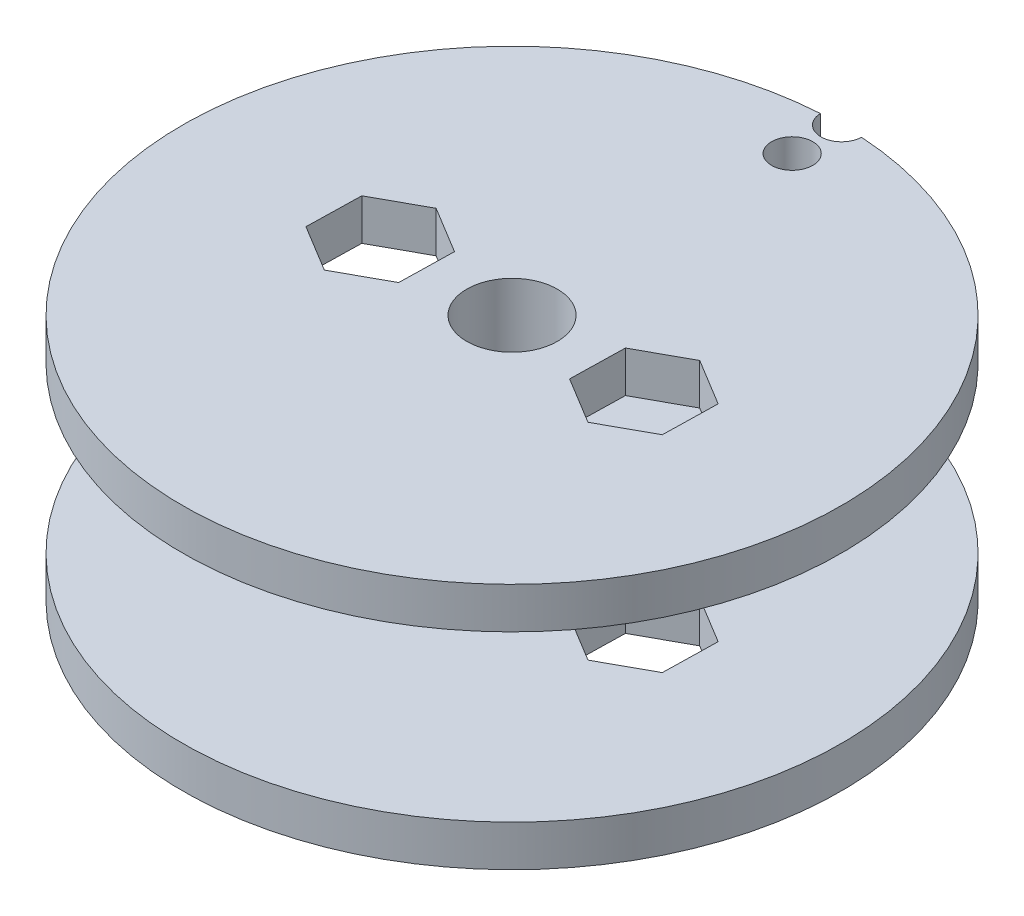
ISO-10303-21;
HEADER;
FILE_DESCRIPTION(('STEP AP214'),'2;1');
FILE_NAME('part.step','',(''),(''),'','','');
FILE_SCHEMA(('AUTOMOTIVE_DESIGN { 1 0 10303 214 1 1 1 1 }'));
ENDSEC;
DATA;
#1=APPLICATION_CONTEXT('core data for automotive mechanical design processes');
#2=APPLICATION_PROTOCOL_DEFINITION('international standard','automotive_design',2000,#1);
#3=PRODUCT_CONTEXT('',#1,'mechanical');
#4=PRODUCT('Part','Part','',(#3));
#5=PRODUCT_RELATED_PRODUCT_CATEGORY('part','',(#4));
#6=PRODUCT_DEFINITION_FORMATION('','',#4);
#7=PRODUCT_DEFINITION_CONTEXT('part definition',#1,'design');
#8=PRODUCT_DEFINITION('design','',#6,#7);
#9=PRODUCT_DEFINITION_SHAPE('','',#8);
#10=(LENGTH_UNIT() NAMED_UNIT(*) SI_UNIT(.MILLI.,.METRE.));
#11=(NAMED_UNIT(*) PLANE_ANGLE_UNIT() SI_UNIT($,.RADIAN.));
#12=(NAMED_UNIT(*) SI_UNIT($,.STERADIAN.) SOLID_ANGLE_UNIT());
#13=UNCERTAINTY_MEASURE_WITH_UNIT(LENGTH_MEASURE(1.E-05),#10,'distance_accuracy_value','');
#14=(GEOMETRIC_REPRESENTATION_CONTEXT(3) GLOBAL_UNCERTAINTY_ASSIGNED_CONTEXT((#13)) GLOBAL_UNIT_ASSIGNED_CONTEXT((#10,
#11,#12)) REPRESENTATION_CONTEXT('',''));
#15=CARTESIAN_POINT('',(0.,0.,0.));
#16=DIRECTION('',(0.,0.,1.));
#17=DIRECTION('',(1.,0.,0.));
#18=AXIS2_PLACEMENT_3D('',#15,#16,#17);
#19=CARTESIAN_POINT('',(0.,2.5,0.));
#20=DIRECTION('',(0.,1.,0.));
#21=DIRECTION('',(0.,0.,1.));
#22=AXIS2_PLACEMENT_3D('',#19,#20,#21);
#23=PLANE('',#22);
#24=DIRECTION('',(-0.0214869779830933,0.,0.999769128237692));
#25=VECTOR('',#24,1.);
#26=CARTESIAN_POINT('',(-5.08999790781407,2.5,-1.59772374233));
#27=LINE('',#26,#25);
#28=CARTESIAN_POINT('',(-5.08999790781407,2.5,-1.59772374233));
#29=VERTEX_POINT('',#28);
#30=CARTESIAN_POINT('',(-5.16132960481908,2.5,1.72127386573417));
#31=VERTEX_POINT('',#30);
#32=EDGE_CURVE('E484',#29,#31,#27,.T.);
#33=ORIENTED_EDGE('',*,*,#32,.T.);
#34=DIRECTION('',(-0.87656895196481,0.,0.48127629533493));
#35=VECTOR('',#34,1.);
#36=CARTESIAN_POINT('',(-5.16132960481908,2.5,1.72127386573417));
#37=LINE('',#36,#35);
#38=CARTESIAN_POINT('',(-8.07133169700495,2.5,3.31899760806487));
#39=VERTEX_POINT('',#38);
#40=EDGE_CURVE('E488',#31,#39,#37,.T.);
#41=ORIENTED_EDGE('',*,*,#40,.T.);
#42=DIRECTION('',(-0.855081973981716,0.,-0.518492832902762));
#43=VECTOR('',#42,1.);
#44=CARTESIAN_POINT('',(-8.07133169700495,2.5,3.31899760806487));
#45=LINE('',#44,#43);
#46=CARTESIAN_POINT('',(-10.9100020921858,2.5,1.59772374233139));
#47=VERTEX_POINT('',#46);
#48=EDGE_CURVE('E493',#39,#47,#45,.T.);
#49=ORIENTED_EDGE('',*,*,#48,.T.);
#50=DIRECTION('',(0.0214869779830943,0.,-0.999769128237692));
#51=VECTOR('',#50,1.);
#52=CARTESIAN_POINT('',(-10.9100020921858,2.5,1.59772374233139));
#53=LINE('',#52,#51);
#54=CARTESIAN_POINT('',(-10.8386703951808,2.5,-1.72127386573279));
#55=VERTEX_POINT('',#54);
#56=EDGE_CURVE('E497',#47,#55,#53,.T.);
#57=ORIENTED_EDGE('',*,*,#56,.T.);
#58=DIRECTION('',(0.87656895196481,0.,-0.48127629533493));
#59=VECTOR('',#58,1.);
#60=CARTESIAN_POINT('',(-10.8386703951808,2.5,-1.72127386573279));
#61=LINE('',#60,#59);
#62=CARTESIAN_POINT('',(-7.92866830299493,2.5,-3.31899760806348));
#63=VERTEX_POINT('',#62);
#64=EDGE_CURVE('E501',#55,#63,#61,.T.);
#65=ORIENTED_EDGE('',*,*,#64,.T.);
#66=DIRECTION('',(0.855081973981716,0.,0.518492832902762));
#67=VECTOR('',#66,1.);
#68=CARTESIAN_POINT('',(-7.92866830299493,2.5,-3.31899760806348));
#69=LINE('',#68,#67);
#70=EDGE_CURVE('E505',#63,#29,#69,.T.);
#71=ORIENTED_EDGE('',*,*,#70,.T.);
#72=EDGE_LOOP('',(#33,#41,#49,#57,#65,#71));
#73=FACE_BOUND('',#72,.T.);
#74=DIRECTION('',(0.0214869779832137,0.,-0.999769128237689));
#75=VECTOR('',#74,1.);
#76=CARTESIAN_POINT('',(5.089997907814,2.5,1.59772374233007));
#77=LINE('',#76,#75);
#78=CARTESIAN_POINT('',(5.089997907814,2.5,1.59772374233007));
#79=VERTEX_POINT('',#78);
#80=CARTESIAN_POINT('',(5.16132960481941,2.5,-1.72127386573409));
#81=VERTEX_POINT('',#80);
#82=EDGE_CURVE('E418',#79,#81,#77,.T.);
#83=ORIENTED_EDGE('',*,*,#82,.T.);
#84=DIRECTION('',(0.876568951964868,0.,-0.481276295334824));
#85=VECTOR('',#84,1.);
#86=CARTESIAN_POINT('',(5.16132960481941,2.5,-1.72127386573409));
#87=LINE('',#86,#85);
#88=CARTESIAN_POINT('',(8.07133169700547,2.5,-3.31899760806444));
#89=VERTEX_POINT('',#88);
#90=EDGE_CURVE('E422',#81,#89,#87,.T.);
#91=ORIENTED_EDGE('',*,*,#90,.T.);
#92=DIRECTION('',(0.855081973981654,0.,0.518492832902865));
#93=VECTOR('',#92,1.);
#94=CARTESIAN_POINT('',(8.07133169700547,2.5,-3.31899760806444));
#95=LINE('',#94,#93);
#96=CARTESIAN_POINT('',(10.9100020921861,2.5,-1.59772374233061));
#97=VERTEX_POINT('',#96);
#98=EDGE_CURVE('E64',#89,#97,#95,.T.);
#99=ORIENTED_EDGE('',*,*,#98,.T.);
#100=DIRECTION('',(-0.021486977983214,0.,0.999769128237689));
#101=VECTOR('',#100,1.);
#102=CARTESIAN_POINT('',(10.9100020921861,2.5,-1.59772374233061));
#103=LINE('',#102,#101);
#104=CARTESIAN_POINT('',(10.8386703951807,2.5,1.72127386573356));
#105=VERTEX_POINT('',#104);
#106=EDGE_CURVE('E429',#97,#105,#103,.T.);
#107=ORIENTED_EDGE('',*,*,#106,.T.);
#108=DIRECTION('',(-0.876568951964868,0.,0.481276295334824));
#109=VECTOR('',#108,1.);
#110=CARTESIAN_POINT('',(10.8386703951807,2.5,1.72127386573356));
#111=LINE('',#110,#109);
#112=CARTESIAN_POINT('',(7.92866830299465,2.5,3.3189976080639));
#113=VERTEX_POINT('',#112);
#114=EDGE_CURVE('E433',#105,#113,#111,.T.);
#115=ORIENTED_EDGE('',*,*,#114,.T.);
#116=DIRECTION('',(-0.855081973981654,0.,-0.518492832902865));
#117=VECTOR('',#116,1.);
#118=CARTESIAN_POINT('',(7.92866830299465,2.5,3.3189976080639));
#119=LINE('',#118,#117);
#120=EDGE_CURVE('E437',#113,#79,#119,.T.);
#121=ORIENTED_EDGE('',*,*,#120,.T.);
#122=EDGE_LOOP('',(#83,#91,#99,#107,#115,#121));
#123=FACE_BOUND('',#122,.T.);
#124=CARTESIAN_POINT('',(0.,2.5,-20.));
#125=DIRECTION('',(0.,1.,0.));
#126=DIRECTION('',(0.,0.,1.));
#127=AXIS2_PLACEMENT_3D('',#124,#125,#126);
#128=CIRCLE('',#127,1.25);
#129=CARTESIAN_POINT('',(-1.24938949935309,2.5,-19.9609375));
#130=VERTEX_POINT('',#129);
#131=CARTESIAN_POINT('',(1.24938949935309,2.5,-19.9609375));
#132=VERTEX_POINT('',#131);
#133=EDGE_CURVE('E409',#130,#132,#128,.T.);
#134=ORIENTED_EDGE('',*,*,#133,.F.);
#135=CARTESIAN_POINT('',(0.,2.5,0.));
#136=DIRECTION('',(0.,1.,0.));
#137=DIRECTION('',(0.,0.,1.));
#138=AXIS2_PLACEMENT_3D('',#135,#136,#137);
#139=CIRCLE('',#138,20.);
#140=EDGE_CURVE('E553',#130,#132,#139,.T.);
#141=ORIENTED_EDGE('',*,*,#140,.T.);
#142=EDGE_LOOP('',(#134,#141));
#143=FACE_BOUND('',#142,.T.);
#144=CARTESIAN_POINT('',(0.,2.5,-17.));
#145=DIRECTION('',(0.,1.,0.));
#146=DIRECTION('',(0.,0.,1.));
#147=AXIS2_PLACEMENT_3D('',#144,#145,#146);
#148=CIRCLE('',#147,1.25);
#149=CARTESIAN_POINT('',(0.,2.5,-15.75));
#150=VERTEX_POINT('',#149);
#151=EDGE_CURVE('E410',#150,#150,#148,.T.);
#152=ORIENTED_EDGE('',*,*,#151,.F.);
#153=EDGE_LOOP('',(#152));
#154=FACE_BOUND('',#153,.T.);
#155=CARTESIAN_POINT('',(0.,2.5,0.));
#156=DIRECTION('',(0.,1.,0.));
#157=DIRECTION('',(0.,0.,1.));
#158=AXIS2_PLACEMENT_3D('',#155,#156,#157);
#159=CIRCLE('',#158,3.);
#160=CARTESIAN_POINT('',(0.,2.5,3.));
#161=VERTEX_POINT('',#160);
#162=EDGE_CURVE('E237',#161,#161,#159,.T.);
#163=ORIENTED_EDGE('',*,*,#162,.F.);
#164=EDGE_LOOP('',(#163));
#165=FACE_BOUND('',#164,.T.);
#166=ADVANCED_FACE('F39',(#73,#123,#143,#154,#165),#23,.T.);
#167=CARTESIAN_POINT('',(0.,0.,0.));
#168=DIRECTION('',(0.,1.,0.));
#169=DIRECTION('',(0.,0.,1.));
#170=AXIS2_PLACEMENT_3D('',#167,#168,#169);
#171=PLANE('',#170);
#172=CARTESIAN_POINT('',(0.,0.,-17.));
#173=DIRECTION('',(0.,1.,0.));
#174=DIRECTION('',(0.,0.,1.));
#175=AXIS2_PLACEMENT_3D('',#172,#173,#174);
#176=CIRCLE('',#175,1.25);
#177=CARTESIAN_POINT('',(0.,0.,-15.75));
#178=VERTEX_POINT('',#177);
#179=EDGE_CURVE('E43',#178,#178,#176,.T.);
#180=ORIENTED_EDGE('',*,*,#179,.T.);
#181=EDGE_LOOP('',(#180));
#182=FACE_BOUND('',#181,.T.);
#183=DIRECTION('',(0.876568951964868,0.,-0.481276295334824));
#184=VECTOR('',#183,1.);
#185=CARTESIAN_POINT('',(5.16132960481941,0.,-1.72127386573409));
#186=LINE('',#185,#184);
#187=CARTESIAN_POINT('',(5.16132960481941,0.,-1.72127386573409));
#188=VERTEX_POINT('',#187);
#189=CARTESIAN_POINT('',(8.07133169700547,0.,-3.31899760806444));
#190=VERTEX_POINT('',#189);
#191=EDGE_CURVE('E445',#188,#190,#186,.T.);
#192=ORIENTED_EDGE('',*,*,#191,.F.);
#193=DIRECTION('',(0.0214869779832137,0.,-0.999769128237689));
#194=VECTOR('',#193,1.);
#195=CARTESIAN_POINT('',(5.089997907814,0.,1.59772374233007));
#196=LINE('',#195,#194);
#197=CARTESIAN_POINT('',(5.089997907814,0.,1.59772374233007));
#198=VERTEX_POINT('',#197);
#199=EDGE_CURVE('E442',#198,#188,#196,.T.);
#200=ORIENTED_EDGE('',*,*,#199,.F.);
#201=DIRECTION('',(-0.855081973981654,0.,-0.518492832902865));
#202=VECTOR('',#201,1.);
#203=CARTESIAN_POINT('',(7.92866830299465,0.,3.3189976080639));
#204=LINE('',#203,#202);
#205=CARTESIAN_POINT('',(7.92866830299465,0.,3.3189976080639));
#206=VERTEX_POINT('',#205);
#207=EDGE_CURVE('E423',#206,#198,#204,.T.);
#208=ORIENTED_EDGE('',*,*,#207,.F.);
#209=DIRECTION('',(-0.876568951964868,0.,0.481276295334824));
#210=VECTOR('',#209,1.);
#211=CARTESIAN_POINT('',(10.8386703951807,0.,1.72127386573356));
#212=LINE('',#211,#210);
#213=CARTESIAN_POINT('',(10.8386703951807,0.,1.72127386573356));
#214=VERTEX_POINT('',#213);
#215=EDGE_CURVE('E458',#214,#206,#212,.T.);
#216=ORIENTED_EDGE('',*,*,#215,.F.);
#217=DIRECTION('',(-0.021486977983214,0.,0.999769128237689));
#218=VECTOR('',#217,1.);
#219=CARTESIAN_POINT('',(10.9100020921861,0.,-1.59772374233061));
#220=LINE('',#219,#218);
#221=CARTESIAN_POINT('',(10.9100020921861,0.,-1.59772374233061));
#222=VERTEX_POINT('',#221);
#223=EDGE_CURVE('E454',#222,#214,#220,.T.);
#224=ORIENTED_EDGE('',*,*,#223,.F.);
#225=DIRECTION('',(0.855081973981654,0.,0.518492832902865));
#226=VECTOR('',#225,1.);
#227=CARTESIAN_POINT('',(8.07133169700547,0.,-3.31899760806444));
#228=LINE('',#227,#226);
#229=EDGE_CURVE('E450',#190,#222,#228,.T.);
#230=ORIENTED_EDGE('',*,*,#229,.F.);
#231=EDGE_LOOP('',(#192,#200,#208,#216,#224,#230));
#232=FACE_BOUND('',#231,.T.);
#233=DIRECTION('',(-0.87656895196481,0.,0.48127629533493));
#234=VECTOR('',#233,1.);
#235=CARTESIAN_POINT('',(-5.16132960481908,0.,1.72127386573417));
#236=LINE('',#235,#234);
#237=CARTESIAN_POINT('',(-5.16132960481908,0.,1.72127386573417));
#238=VERTEX_POINT('',#237);
#239=CARTESIAN_POINT('',(-8.07133169700495,0.,3.31899760806487));
#240=VERTEX_POINT('',#239);
#241=EDGE_CURVE('E513',#238,#240,#236,.T.);
#242=ORIENTED_EDGE('',*,*,#241,.F.);
#243=DIRECTION('',(-0.0214869779830933,0.,0.999769128237692));
#244=VECTOR('',#243,1.);
#245=CARTESIAN_POINT('',(-5.08999790781407,0.,-1.59772374233));
#246=LINE('',#245,#244);
#247=CARTESIAN_POINT('',(-5.08999790781407,0.,-1.59772374233));
#248=VERTEX_POINT('',#247);
#249=EDGE_CURVE('E510',#248,#238,#246,.T.);
#250=ORIENTED_EDGE('',*,*,#249,.F.);
#251=DIRECTION('',(0.855081973981716,0.,0.518492832902762));
#252=VECTOR('',#251,1.);
#253=CARTESIAN_POINT('',(-7.92866830299493,0.,-3.31899760806348));
#254=LINE('',#253,#252);
#255=CARTESIAN_POINT('',(-7.92866830299493,0.,-3.31899760806348));
#256=VERTEX_POINT('',#255);
#257=EDGE_CURVE('E489',#256,#248,#254,.T.);
#258=ORIENTED_EDGE('',*,*,#257,.F.);
#259=DIRECTION('',(0.87656895196481,0.,-0.48127629533493));
#260=VECTOR('',#259,1.);
#261=CARTESIAN_POINT('',(-10.8386703951808,0.,-1.72127386573279));
#262=LINE('',#261,#260);
#263=CARTESIAN_POINT('',(-10.8386703951808,0.,-1.72127386573279));
#264=VERTEX_POINT('',#263);
#265=EDGE_CURVE('E525',#264,#256,#262,.T.);
#266=ORIENTED_EDGE('',*,*,#265,.F.);
#267=DIRECTION('',(0.0214869779830943,0.,-0.999769128237692));
#268=VECTOR('',#267,1.);
#269=CARTESIAN_POINT('',(-10.9100020921858,0.,1.59772374233139));
#270=LINE('',#269,#268);
#271=CARTESIAN_POINT('',(-10.9100020921858,0.,1.59772374233139));
#272=VERTEX_POINT('',#271);
#273=EDGE_CURVE('E521',#272,#264,#270,.T.);
#274=ORIENTED_EDGE('',*,*,#273,.F.);
#275=DIRECTION('',(-0.855081973981716,0.,-0.518492832902762));
#276=VECTOR('',#275,1.);
#277=CARTESIAN_POINT('',(-8.07133169700495,0.,3.31899760806487));
#278=LINE('',#277,#276);
#279=EDGE_CURVE('E517',#240,#272,#278,.T.);
#280=ORIENTED_EDGE('',*,*,#279,.F.);
#281=EDGE_LOOP('',(#242,#250,#258,#266,#274,#280));
#282=FACE_BOUND('',#281,.T.);
#283=CARTESIAN_POINT('',(0.,0.,0.));
#284=DIRECTION('',(0.,1.,0.));
#285=DIRECTION('',(0.,0.,1.));
#286=AXIS2_PLACEMENT_3D('',#283,#284,#285);
#287=CIRCLE('',#286,20.);
#288=CARTESIAN_POINT('',(-1.24938949935309,0.,-19.9609375));
#289=VERTEX_POINT('',#288);
#290=CARTESIAN_POINT('',(1.24938949935308,0.,-19.9609375));
#291=VERTEX_POINT('',#290);
#292=EDGE_CURVE('E552',#289,#291,#287,.T.);
#293=ORIENTED_EDGE('',*,*,#292,.F.);
#294=CARTESIAN_POINT('',(0.,0.,-20.));
#295=DIRECTION('',(0.,1.,0.));
#296=DIRECTION('',(0.,0.,1.));
#297=AXIS2_PLACEMENT_3D('',#294,#295,#296);
#298=CIRCLE('',#297,1.25);
#299=EDGE_CURVE('E56',#289,#291,#298,.T.);
#300=ORIENTED_EDGE('',*,*,#299,.T.);
#301=EDGE_LOOP('',(#293,#300));
#302=FACE_BOUND('',#301,.T.);
#303=CARTESIAN_POINT('',(0.,0.,0.));
#304=DIRECTION('',(0.,1.,0.));
#305=DIRECTION('',(0.,0.,1.));
#306=AXIS2_PLACEMENT_3D('',#303,#304,#305);
#307=CIRCLE('',#306,2.75);
#308=CARTESIAN_POINT('',(0.,0.,2.75));
#309=VERTEX_POINT('',#308);
#310=EDGE_CURVE('E468',#309,#309,#307,.T.);
#311=ORIENTED_EDGE('',*,*,#310,.T.);
#312=EDGE_LOOP('',(#311));
#313=FACE_BOUND('',#312,.T.);
#314=ADVANCED_FACE('F566',(#182,#232,#282,#302,#313),#171,.F.);
#315=CARTESIAN_POINT('',(0.,2.5,0.));
#316=DIRECTION('',(0.,-1.,0.));
#317=DIRECTION('',(0.,0.,-1.));
#318=AXIS2_PLACEMENT_3D('',#315,#316,#317);
#319=CYLINDRICAL_SURFACE('',#318,20.);
#320=ORIENTED_EDGE('',*,*,#292,.T.);
#321=DIRECTION('',(0.,1.,0.));
#322=VECTOR('',#321,1.);
#323=CARTESIAN_POINT('',(1.24938949935309,0.,-19.9609375));
#324=LINE('',#323,#322);
#325=EDGE_CURVE('E11',#291,#132,#324,.T.);
#326=ORIENTED_EDGE('',*,*,#325,.T.);
#327=ORIENTED_EDGE('',*,*,#140,.F.);
#328=DIRECTION('',(0.,1.,0.));
#329=VECTOR('',#328,1.);
#330=CARTESIAN_POINT('',(-1.24938949935309,0.,-19.9609375));
#331=LINE('',#330,#329);
#332=EDGE_CURVE('E49',#130,#289,#331,.F.);
#333=ORIENTED_EDGE('',*,*,#332,.T.);
#334=EDGE_LOOP('',(#320,#326,#327,#333));
#335=FACE_BOUND('',#334,.T.);
#336=ADVANCED_FACE('F41',(#335),#319,.T.);
#337=CARTESIAN_POINT('',(0.,2.5,0.));
#338=DIRECTION('',(0.,-1.,0.));
#339=DIRECTION('',(0.,0.,-1.));
#340=AXIS2_PLACEMENT_3D('',#337,#338,#339);
#341=CYLINDRICAL_SURFACE('',#340,2.75);
#342=ORIENTED_EDGE('',*,*,#310,.F.);
#343=EDGE_LOOP('',(#342));
#344=FACE_BOUND('',#343,.T.);
#345=CARTESIAN_POINT('',(0.,15.,0.));
#346=DIRECTION('',(0.,1.,0.));
#347=DIRECTION('',(0.,0.,1.));
#348=AXIS2_PLACEMENT_3D('',#345,#346,#347);
#349=CIRCLE('',#348,2.75);
#350=CARTESIAN_POINT('',(0.,15.,2.75));
#351=VERTEX_POINT('',#350);
#352=EDGE_CURVE('E316',#351,#351,#349,.T.);
#353=ORIENTED_EDGE('',*,*,#352,.T.);
#354=EDGE_LOOP('',(#353));
#355=FACE_BOUND('',#354,.T.);
#356=ADVANCED_FACE('F572',(#344,#355),#341,.F.);
#357=CARTESIAN_POINT('',(-5.08999790781407,2.5,-1.59772374233));
#358=DIRECTION('',(0.999769128237692,0.,0.0214869779830933));
#359=DIRECTION('',(0.0214869779830933,0.,-0.999769128237692));
#360=AXIS2_PLACEMENT_3D('',#357,#358,#359);
#361=PLANE('',#360);
#362=ORIENTED_EDGE('',*,*,#249,.T.);
#363=DIRECTION('',(0.,-1.,0.));
#364=VECTOR('',#363,1.);
#365=CARTESIAN_POINT('',(-5.16132960481908,2.5,1.72127386573417));
#366=LINE('',#365,#364);
#367=EDGE_CURVE('E509',#31,#238,#366,.T.);
#368=ORIENTED_EDGE('',*,*,#367,.F.);
#369=ORIENTED_EDGE('',*,*,#32,.F.);
#370=DIRECTION('',(0.,-1.,0.));
#371=VECTOR('',#370,1.);
#372=CARTESIAN_POINT('',(-5.08999790781407,2.5,-1.59772374233));
#373=LINE('',#372,#371);
#374=EDGE_CURVE('E446',#29,#248,#373,.T.);
#375=ORIENTED_EDGE('',*,*,#374,.T.);
#376=EDGE_LOOP('',(#362,#368,#369,#375));
#377=FACE_BOUND('',#376,.T.);
#378=ADVANCED_FACE('F575',(#377),#361,.F.);
#379=CARTESIAN_POINT('',(-7.92866830299493,2.5,-3.31899760806348));
#380=DIRECTION('',(0.518492832902762,0.,-0.855081973981716));
#381=DIRECTION('',(-0.855081973981716,0.,-0.518492832902762));
#382=AXIS2_PLACEMENT_3D('',#379,#380,#381);
#383=PLANE('',#382);
#384=ORIENTED_EDGE('',*,*,#257,.T.);
#385=ORIENTED_EDGE('',*,*,#374,.F.);
#386=ORIENTED_EDGE('',*,*,#70,.F.);
#387=DIRECTION('',(0.,-1.,0.));
#388=VECTOR('',#387,1.);
#389=CARTESIAN_POINT('',(-7.92866830299493,2.5,-3.31899760806348));
#390=LINE('',#389,#388);
#391=EDGE_CURVE('E534',#63,#256,#390,.T.);
#392=ORIENTED_EDGE('',*,*,#391,.T.);
#393=EDGE_LOOP('',(#384,#385,#386,#392));
#394=FACE_BOUND('',#393,.T.);
#395=ADVANCED_FACE('F603',(#394),#383,.F.);
#396=CARTESIAN_POINT('',(-10.8386703951808,2.5,-1.72127386573279));
#397=DIRECTION('',(-0.48127629533493,0.,-0.87656895196481));
#398=DIRECTION('',(-0.87656895196481,0.,0.48127629533493));
#399=AXIS2_PLACEMENT_3D('',#396,#397,#398);
#400=PLANE('',#399);
#401=ORIENTED_EDGE('',*,*,#265,.T.);
#402=ORIENTED_EDGE('',*,*,#391,.F.);
#403=ORIENTED_EDGE('',*,*,#64,.F.);
#404=DIRECTION('',(0.,-1.,0.));
#405=VECTOR('',#404,1.);
#406=CARTESIAN_POINT('',(-10.8386703951808,2.5,-1.72127386573279));
#407=LINE('',#406,#405);
#408=EDGE_CURVE('E537',#55,#264,#407,.T.);
#409=ORIENTED_EDGE('',*,*,#408,.T.);
#410=EDGE_LOOP('',(#401,#402,#403,#409));
#411=FACE_BOUND('',#410,.T.);
#412=ADVANCED_FACE('F617',(#411),#400,.F.);
#413=CARTESIAN_POINT('',(-10.9100020921858,2.5,1.59772374233139));
#414=DIRECTION('',(-0.999769128237692,0.,-0.0214869779830943));
#415=DIRECTION('',(-0.0214869779830943,0.,0.999769128237692));
#416=AXIS2_PLACEMENT_3D('',#413,#414,#415);
#417=PLANE('',#416);
#418=ORIENTED_EDGE('',*,*,#273,.T.);
#419=ORIENTED_EDGE('',*,*,#408,.F.);
#420=ORIENTED_EDGE('',*,*,#56,.F.);
#421=DIRECTION('',(0.,-1.,0.));
#422=VECTOR('',#421,1.);
#423=CARTESIAN_POINT('',(-10.9100020921858,2.5,1.59772374233139));
#424=LINE('',#423,#422);
#425=EDGE_CURVE('E540',#47,#272,#424,.T.);
#426=ORIENTED_EDGE('',*,*,#425,.T.);
#427=EDGE_LOOP('',(#418,#419,#420,#426));
#428=FACE_BOUND('',#427,.T.);
#429=ADVANCED_FACE('F613',(#428),#417,.F.);
#430=CARTESIAN_POINT('',(-8.07133169700495,2.5,3.31899760806487));
#431=DIRECTION('',(-0.518492832902762,0.,0.855081973981716));
#432=DIRECTION('',(0.855081973981716,0.,0.518492832902762));
#433=AXIS2_PLACEMENT_3D('',#430,#431,#432);
#434=PLANE('',#433);
#435=ORIENTED_EDGE('',*,*,#279,.T.);
#436=ORIENTED_EDGE('',*,*,#425,.F.);
#437=ORIENTED_EDGE('',*,*,#48,.F.);
#438=DIRECTION('',(0.,-1.,0.));
#439=VECTOR('',#438,1.);
#440=CARTESIAN_POINT('',(-8.07133169700495,2.5,3.31899760806487));
#441=LINE('',#440,#439);
#442=EDGE_CURVE('E543',#39,#240,#441,.T.);
#443=ORIENTED_EDGE('',*,*,#442,.T.);
#444=EDGE_LOOP('',(#435,#436,#437,#443));
#445=FACE_BOUND('',#444,.T.);
#446=ADVANCED_FACE('F609',(#445),#434,.F.);
#447=CARTESIAN_POINT('',(-5.16132960481908,2.5,1.72127386573417));
#448=DIRECTION('',(0.48127629533493,0.,0.87656895196481));
#449=DIRECTION('',(0.87656895196481,0.,-0.48127629533493));
#450=AXIS2_PLACEMENT_3D('',#447,#448,#449);
#451=PLANE('',#450);
#452=ORIENTED_EDGE('',*,*,#241,.T.);
#453=ORIENTED_EDGE('',*,*,#442,.F.);
#454=ORIENTED_EDGE('',*,*,#40,.F.);
#455=ORIENTED_EDGE('',*,*,#367,.T.);
#456=EDGE_LOOP('',(#452,#453,#454,#455));
#457=FACE_BOUND('',#456,.T.);
#458=ADVANCED_FACE('F605',(#457),#451,.F.);
#459=CARTESIAN_POINT('',(5.089997907814,2.5,1.59772374233007));
#460=DIRECTION('',(-0.999769128237689,0.,-0.0214869779832137));
#461=DIRECTION('',(-0.0214869779832137,0.,0.999769128237689));
#462=AXIS2_PLACEMENT_3D('',#459,#460,#461);
#463=PLANE('',#462);
#464=ORIENTED_EDGE('',*,*,#199,.T.);
#465=DIRECTION('',(0.,-1.,0.));
#466=VECTOR('',#465,1.);
#467=CARTESIAN_POINT('',(5.16132960481941,2.5,-1.72127386573409));
#468=LINE('',#467,#466);
#469=EDGE_CURVE('E441',#81,#188,#468,.T.);
#470=ORIENTED_EDGE('',*,*,#469,.F.);
#471=ORIENTED_EDGE('',*,*,#82,.F.);
#472=DIRECTION('',(0.,-1.,0.));
#473=VECTOR('',#472,1.);
#474=CARTESIAN_POINT('',(5.089997907814,2.5,1.59772374233007));
#475=LINE('',#474,#473);
#476=EDGE_CURVE('E465',#79,#198,#475,.T.);
#477=ORIENTED_EDGE('',*,*,#476,.T.);
#478=EDGE_LOOP('',(#464,#470,#471,#477));
#479=FACE_BOUND('',#478,.T.);
#480=ADVANCED_FACE('F608',(#479),#463,.F.);
#481=CARTESIAN_POINT('',(7.92866830299465,2.5,3.3189976080639));
#482=DIRECTION('',(-0.518492832902865,0.,0.855081973981654));
#483=DIRECTION('',(0.855081973981654,0.,0.518492832902865));
#484=AXIS2_PLACEMENT_3D('',#481,#482,#483);
#485=PLANE('',#484);
#486=ORIENTED_EDGE('',*,*,#207,.T.);
#487=ORIENTED_EDGE('',*,*,#476,.F.);
#488=ORIENTED_EDGE('',*,*,#120,.F.);
#489=DIRECTION('',(0.,-1.,0.));
#490=VECTOR('',#489,1.);
#491=CARTESIAN_POINT('',(7.92866830299465,2.5,3.3189976080639));
#492=LINE('',#491,#490);
#493=EDGE_CURVE('E469',#113,#206,#492,.T.);
#494=ORIENTED_EDGE('',*,*,#493,.T.);
#495=EDGE_LOOP('',(#486,#487,#488,#494));
#496=FACE_BOUND('',#495,.T.);
#497=ADVANCED_FACE('F627',(#496),#485,.F.);
#498=CARTESIAN_POINT('',(10.8386703951807,2.5,1.72127386573356));
#499=DIRECTION('',(0.481276295334824,0.,0.876568951964868));
#500=DIRECTION('',(0.876568951964868,0.,-0.481276295334824));
#501=AXIS2_PLACEMENT_3D('',#498,#499,#500);
#502=PLANE('',#501);
#503=ORIENTED_EDGE('',*,*,#215,.T.);
#504=ORIENTED_EDGE('',*,*,#493,.F.);
#505=ORIENTED_EDGE('',*,*,#114,.F.);
#506=DIRECTION('',(0.,-1.,0.));
#507=VECTOR('',#506,1.);
#508=CARTESIAN_POINT('',(10.8386703951807,2.5,1.72127386573356));
#509=LINE('',#508,#507);
#510=EDGE_CURVE('E472',#105,#214,#509,.T.);
#511=ORIENTED_EDGE('',*,*,#510,.T.);
#512=EDGE_LOOP('',(#503,#504,#505,#511));
#513=FACE_BOUND('',#512,.T.);
#514=ADVANCED_FACE('F640',(#513),#502,.F.);
#515=CARTESIAN_POINT('',(10.9100020921861,2.5,-1.59772374233061));
#516=DIRECTION('',(0.999769128237689,0.,0.021486977983214));
#517=DIRECTION('',(0.021486977983214,0.,-0.999769128237689));
#518=AXIS2_PLACEMENT_3D('',#515,#516,#517);
#519=PLANE('',#518);
#520=ORIENTED_EDGE('',*,*,#223,.T.);
#521=ORIENTED_EDGE('',*,*,#510,.F.);
#522=ORIENTED_EDGE('',*,*,#106,.F.);
#523=DIRECTION('',(0.,-1.,0.));
#524=VECTOR('',#523,1.);
#525=CARTESIAN_POINT('',(10.9100020921861,2.5,-1.59772374233061));
#526=LINE('',#525,#524);
#527=EDGE_CURVE('E475',#97,#222,#526,.T.);
#528=ORIENTED_EDGE('',*,*,#527,.T.);
#529=EDGE_LOOP('',(#520,#521,#522,#528));
#530=FACE_BOUND('',#529,.T.);
#531=ADVANCED_FACE('F637',(#530),#519,.F.);
#532=CARTESIAN_POINT('',(8.07133169700547,2.5,-3.31899760806444));
#533=DIRECTION('',(0.518492832902865,0.,-0.855081973981654));
#534=DIRECTION('',(-0.855081973981654,0.,-0.518492832902865));
#535=AXIS2_PLACEMENT_3D('',#532,#533,#534);
#536=PLANE('',#535);
#537=ORIENTED_EDGE('',*,*,#229,.T.);
#538=ORIENTED_EDGE('',*,*,#527,.F.);
#539=ORIENTED_EDGE('',*,*,#98,.F.);
#540=DIRECTION('',(0.,-1.,0.));
#541=VECTOR('',#540,1.);
#542=CARTESIAN_POINT('',(8.07133169700547,2.5,-3.31899760806444));
#543=LINE('',#542,#541);
#544=EDGE_CURVE('E478',#89,#190,#543,.T.);
#545=ORIENTED_EDGE('',*,*,#544,.T.);
#546=EDGE_LOOP('',(#537,#538,#539,#545));
#547=FACE_BOUND('',#546,.T.);
#548=ADVANCED_FACE('F633',(#547),#536,.F.);
#549=CARTESIAN_POINT('',(5.16132960481941,2.5,-1.72127386573409));
#550=DIRECTION('',(-0.481276295334824,0.,-0.876568951964868));
#551=DIRECTION('',(-0.876568951964868,0.,0.481276295334825));
#552=AXIS2_PLACEMENT_3D('',#549,#550,#551);
#553=PLANE('',#552);
#554=ORIENTED_EDGE('',*,*,#191,.T.);
#555=ORIENTED_EDGE('',*,*,#544,.F.);
#556=ORIENTED_EDGE('',*,*,#90,.F.);
#557=ORIENTED_EDGE('',*,*,#469,.T.);
#558=EDGE_LOOP('',(#554,#555,#556,#557));
#559=FACE_BOUND('',#558,.T.);
#560=ADVANCED_FACE('F629',(#559),#553,.F.);
#561=CARTESIAN_POINT('',(0.,-2.5,-20.));
#562=DIRECTION('',(0.,1.,0.));
#563=DIRECTION('',(0.,0.,1.));
#564=AXIS2_PLACEMENT_3D('',#561,#562,#563);
#565=CYLINDRICAL_SURFACE('',#564,1.25);
#566=ORIENTED_EDGE('',*,*,#299,.F.);
#567=ORIENTED_EDGE('',*,*,#332,.F.);
#568=ORIENTED_EDGE('',*,*,#133,.T.);
#569=ORIENTED_EDGE('',*,*,#325,.F.);
#570=EDGE_LOOP('',(#566,#567,#568,#569));
#571=FACE_BOUND('',#570,.T.);
#572=ADVANCED_FACE('F632',(#571),#565,.F.);
#573=CARTESIAN_POINT('',(0.,-2.5,-17.));
#574=DIRECTION('',(0.,1.,0.));
#575=DIRECTION('',(0.,0.,1.));
#576=AXIS2_PLACEMENT_3D('',#573,#574,#575);
#577=CYLINDRICAL_SURFACE('',#576,1.25);
#578=ORIENTED_EDGE('',*,*,#151,.T.);
#579=EDGE_LOOP('',(#578));
#580=FACE_BOUND('',#579,.T.);
#581=ORIENTED_EDGE('',*,*,#179,.F.);
#582=EDGE_LOOP('',(#581));
#583=FACE_BOUND('',#582,.T.);
#584=ADVANCED_FACE('F650',(#580,#583),#577,.F.);
#585=CARTESIAN_POINT('',(0.,7.5,0.));
#586=DIRECTION('',(0.,-1.,0.));
#587=DIRECTION('',(0.,0.,-1.));
#588=AXIS2_PLACEMENT_3D('',#585,#586,#587);
#589=CYLINDRICAL_SURFACE('',#588,3.);
#590=ORIENTED_EDGE('',*,*,#162,.T.);
#591=EDGE_LOOP('',(#590));
#592=FACE_BOUND('',#591,.T.);
#593=CARTESIAN_POINT('',(0.,12.5,0.));
#594=DIRECTION('',(0.,1.,0.));
#595=DIRECTION('',(0.,0.,1.));
#596=AXIS2_PLACEMENT_3D('',#593,#594,#595);
#597=CIRCLE('',#596,3.);
#598=CARTESIAN_POINT('',(0.,12.5,3.));
#599=VERTEX_POINT('',#598);
#600=EDGE_CURVE('E251',#599,#599,#597,.T.);
#601=ORIENTED_EDGE('',*,*,#600,.F.);
#602=EDGE_LOOP('',(#601));
#603=FACE_BOUND('',#602,.T.);
#604=ADVANCED_FACE('F589',(#592,#603),#589,.T.);
#605=CARTESIAN_POINT('',(0.,12.5,0.));
#606=DIRECTION('',(0.,-1.,0.));
#607=DIRECTION('',(0.,0.,1.));
#608=AXIS2_PLACEMENT_3D('',#605,#606,#607);
#609=PLANE('',#608);
#610=DIRECTION('',(-0.0214869779830933,0.,0.999769128237692));
#611=VECTOR('',#610,1.);
#612=CARTESIAN_POINT('',(-5.08999790781407,12.5,-1.59772374233));
#613=LINE('',#612,#611);
#614=CARTESIAN_POINT('',(-5.08999790781407,12.5,-1.59772374233));
#615=VERTEX_POINT('',#614);
#616=CARTESIAN_POINT('',(-5.16132960481908,12.5,1.72127386573417));
#617=VERTEX_POINT('',#616);
#618=EDGE_CURVE('E331',#615,#617,#613,.T.);
#619=ORIENTED_EDGE('',*,*,#618,.F.);
#620=DIRECTION('',(0.855081973981716,0.,0.518492832902762));
#621=VECTOR('',#620,1.);
#622=CARTESIAN_POINT('',(-7.92866830299493,12.5,-3.31899760806348));
#623=LINE('',#622,#621);
#624=CARTESIAN_POINT('',(-7.92866830299493,12.5,-3.31899760806348));
#625=VERTEX_POINT('',#624);
#626=EDGE_CURVE('E352',#625,#615,#623,.T.);
#627=ORIENTED_EDGE('',*,*,#626,.F.);
#628=DIRECTION('',(0.87656895196481,0.,-0.48127629533493));
#629=VECTOR('',#628,1.);
#630=CARTESIAN_POINT('',(-10.8386703951808,12.5,-1.72127386573279));
#631=LINE('',#630,#629);
#632=CARTESIAN_POINT('',(-10.8386703951808,12.5,-1.72127386573279));
#633=VERTEX_POINT('',#632);
#634=EDGE_CURVE('E348',#633,#625,#631,.T.);
#635=ORIENTED_EDGE('',*,*,#634,.F.);
#636=DIRECTION('',(0.0214869779830943,0.,-0.999769128237692));
#637=VECTOR('',#636,1.);
#638=CARTESIAN_POINT('',(-10.9100020921858,12.5,1.59772374233139));
#639=LINE('',#638,#637);
#640=CARTESIAN_POINT('',(-10.9100020921858,12.5,1.59772374233139));
#641=VERTEX_POINT('',#640);
#642=EDGE_CURVE('E344',#641,#633,#639,.T.);
#643=ORIENTED_EDGE('',*,*,#642,.F.);
#644=DIRECTION('',(-0.855081973981716,0.,-0.518492832902762));
#645=VECTOR('',#644,1.);
#646=CARTESIAN_POINT('',(-8.07133169700495,12.5,3.31899760806487));
#647=LINE('',#646,#645);
#648=CARTESIAN_POINT('',(-8.07133169700495,12.5,3.31899760806487));
#649=VERTEX_POINT('',#648);
#650=EDGE_CURVE('E340',#649,#641,#647,.T.);
#651=ORIENTED_EDGE('',*,*,#650,.F.);
#652=DIRECTION('',(-0.87656895196481,0.,0.48127629533493));
#653=VECTOR('',#652,1.);
#654=CARTESIAN_POINT('',(-5.16132960481908,12.5,1.72127386573417));
#655=LINE('',#654,#653);
#656=EDGE_CURVE('E335',#617,#649,#655,.T.);
#657=ORIENTED_EDGE('',*,*,#656,.F.);
#658=EDGE_LOOP('',(#619,#627,#635,#643,#651,#657));
#659=FACE_BOUND('',#658,.T.);
#660=DIRECTION('',(0.0214869779832137,0.,-0.999769128237689));
#661=VECTOR('',#660,1.);
#662=CARTESIAN_POINT('',(5.089997907814,12.5,1.59772374233007));
#663=LINE('',#662,#661);
#664=CARTESIAN_POINT('',(5.089997907814,12.5,1.59772374233007));
#665=VERTEX_POINT('',#664);
#666=CARTESIAN_POINT('',(5.16132960481941,12.5,-1.72127386573409));
#667=VERTEX_POINT('',#666);
#668=EDGE_CURVE('E263',#665,#667,#663,.T.);
#669=ORIENTED_EDGE('',*,*,#668,.F.);
#670=DIRECTION('',(-0.855081973981654,0.,-0.518492832902865));
#671=VECTOR('',#670,1.);
#672=CARTESIAN_POINT('',(7.92866830299465,12.5,3.3189976080639));
#673=LINE('',#672,#671);
#674=CARTESIAN_POINT('',(7.92866830299465,12.5,3.3189976080639));
#675=VERTEX_POINT('',#674);
#676=EDGE_CURVE('E284',#675,#665,#673,.T.);
#677=ORIENTED_EDGE('',*,*,#676,.F.);
#678=DIRECTION('',(-0.876568951964868,0.,0.481276295334824));
#679=VECTOR('',#678,1.);
#680=CARTESIAN_POINT('',(10.8386703951807,12.5,1.72127386573356));
#681=LINE('',#680,#679);
#682=CARTESIAN_POINT('',(10.8386703951807,12.5,1.72127386573356));
#683=VERTEX_POINT('',#682);
#684=EDGE_CURVE('E280',#683,#675,#681,.T.);
#685=ORIENTED_EDGE('',*,*,#684,.F.);
#686=DIRECTION('',(-0.021486977983214,0.,0.999769128237689));
#687=VECTOR('',#686,1.);
#688=CARTESIAN_POINT('',(10.9100020921861,12.5,-1.59772374233061));
#689=LINE('',#688,#687);
#690=CARTESIAN_POINT('',(10.9100020921861,12.5,-1.59772374233061));
#691=VERTEX_POINT('',#690);
#692=EDGE_CURVE('E276',#691,#683,#689,.T.);
#693=ORIENTED_EDGE('',*,*,#692,.F.);
#694=DIRECTION('',(0.855081973981654,0.,0.518492832902865));
#695=VECTOR('',#694,1.);
#696=CARTESIAN_POINT('',(8.07133169700547,12.5,-3.31899760806444));
#697=LINE('',#696,#695);
#698=CARTESIAN_POINT('',(8.07133169700547,12.5,-3.31899760806444));
#699=VERTEX_POINT('',#698);
#700=EDGE_CURVE('E272',#699,#691,#697,.T.);
#701=ORIENTED_EDGE('',*,*,#700,.F.);
#702=DIRECTION('',(0.876568951964868,0.,-0.481276295334824));
#703=VECTOR('',#702,1.);
#704=CARTESIAN_POINT('',(5.16132960481941,12.5,-1.72127386573409));
#705=LINE('',#704,#703);
#706=EDGE_CURVE('E267',#667,#699,#705,.T.);
#707=ORIENTED_EDGE('',*,*,#706,.F.);
#708=EDGE_LOOP('',(#669,#677,#685,#693,#701,#707));
#709=FACE_BOUND('',#708,.T.);
#710=CARTESIAN_POINT('',(0.,12.5,-20.));
#711=DIRECTION('',(0.,1.,0.));
#712=DIRECTION('',(0.,0.,1.));
#713=AXIS2_PLACEMENT_3D('',#710,#711,#712);
#714=CIRCLE('',#713,1.25);
#715=CARTESIAN_POINT('',(-1.24938949935309,12.5,-19.9609375));
#716=VERTEX_POINT('',#715);
#717=CARTESIAN_POINT('',(1.24938949935309,12.5,-19.9609375));
#718=VERTEX_POINT('',#717);
#719=EDGE_CURVE('E230',#716,#718,#714,.T.);
#720=ORIENTED_EDGE('',*,*,#719,.T.);
#721=CARTESIAN_POINT('',(0.,12.5,0.));
#722=DIRECTION('',(0.,1.,0.));
#723=DIRECTION('',(0.,0.,1.));
#724=AXIS2_PLACEMENT_3D('',#721,#722,#723);
#725=CIRCLE('',#724,20.);
#726=EDGE_CURVE('E241',#716,#718,#725,.T.);
#727=ORIENTED_EDGE('',*,*,#726,.F.);
#728=EDGE_LOOP('',(#720,#727));
#729=FACE_BOUND('',#728,.T.);
#730=CARTESIAN_POINT('',(0.,12.5,-17.));
#731=DIRECTION('',(0.,1.,0.));
#732=DIRECTION('',(0.,0.,1.));
#733=AXIS2_PLACEMENT_3D('',#730,#731,#732);
#734=CIRCLE('',#733,1.25);
#735=CARTESIAN_POINT('',(0.,12.5,-15.75));
#736=VERTEX_POINT('',#735);
#737=EDGE_CURVE('E250',#736,#736,#734,.T.);
#738=ORIENTED_EDGE('',*,*,#737,.T.);
#739=EDGE_LOOP('',(#738));
#740=FACE_BOUND('',#739,.T.);
#741=ORIENTED_EDGE('',*,*,#600,.T.);
#742=EDGE_LOOP('',(#741));
#743=FACE_BOUND('',#742,.T.);
#744=ADVANCED_FACE('F247',(#659,#709,#729,#740,#743),#609,.T.);
#745=CARTESIAN_POINT('',(0.,15.,0.));
#746=DIRECTION('',(0.,-1.,0.));
#747=DIRECTION('',(0.,0.,1.));
#748=AXIS2_PLACEMENT_3D('',#745,#746,#747);
#749=PLANE('',#748);
#750=CARTESIAN_POINT('',(0.,15.,-17.));
#751=DIRECTION('',(0.,1.,0.));
#752=DIRECTION('',(0.,0.,1.));
#753=AXIS2_PLACEMENT_3D('',#750,#751,#752);
#754=CIRCLE('',#753,1.25);
#755=CARTESIAN_POINT('',(0.,15.,-15.75));
#756=VERTEX_POINT('',#755);
#757=EDGE_CURVE('E262',#756,#756,#754,.T.);
#758=ORIENTED_EDGE('',*,*,#757,.F.);
#759=EDGE_LOOP('',(#758));
#760=FACE_BOUND('',#759,.T.);
#761=DIRECTION('',(0.876568951964868,0.,-0.481276295334824));
#762=VECTOR('',#761,1.);
#763=CARTESIAN_POINT('',(5.16132960481941,15.,-1.72127386573409));
#764=LINE('',#763,#762);
#765=CARTESIAN_POINT('',(5.16132960481941,15.,-1.72127386573409));
#766=VERTEX_POINT('',#765);
#767=CARTESIAN_POINT('',(8.07133169700547,15.,-3.31899760806444));
#768=VERTEX_POINT('',#767);
#769=EDGE_CURVE('E293',#766,#768,#764,.T.);
#770=ORIENTED_EDGE('',*,*,#769,.T.);
#771=DIRECTION('',(0.855081973981654,0.,0.518492832902865));
#772=VECTOR('',#771,1.);
#773=CARTESIAN_POINT('',(8.07133169700547,15.,-3.31899760806444));
#774=LINE('',#773,#772);
#775=CARTESIAN_POINT('',(10.9100020921861,15.,-1.59772374233061));
#776=VERTEX_POINT('',#775);
#777=EDGE_CURVE('E298',#768,#776,#774,.T.);
#778=ORIENTED_EDGE('',*,*,#777,.T.);
#779=DIRECTION('',(-0.021486977983214,0.,0.999769128237689));
#780=VECTOR('',#779,1.);
#781=CARTESIAN_POINT('',(10.9100020921861,15.,-1.59772374233061));
#782=LINE('',#781,#780);
#783=CARTESIAN_POINT('',(10.8386703951807,15.,1.72127386573356));
#784=VERTEX_POINT('',#783);
#785=EDGE_CURVE('E302',#776,#784,#782,.T.);
#786=ORIENTED_EDGE('',*,*,#785,.T.);
#787=DIRECTION('',(-0.876568951964868,0.,0.481276295334824));
#788=VECTOR('',#787,1.);
#789=CARTESIAN_POINT('',(10.8386703951807,15.,1.72127386573356));
#790=LINE('',#789,#788);
#791=CARTESIAN_POINT('',(7.92866830299465,15.,3.3189976080639));
#792=VERTEX_POINT('',#791);
#793=EDGE_CURVE('E306',#784,#792,#790,.T.);
#794=ORIENTED_EDGE('',*,*,#793,.T.);
#795=DIRECTION('',(-0.855081973981654,0.,-0.518492832902865));
#796=VECTOR('',#795,1.);
#797=CARTESIAN_POINT('',(7.92866830299465,15.,3.3189976080639));
#798=LINE('',#797,#796);
#799=CARTESIAN_POINT('',(5.089997907814,15.,1.59772374233007));
#800=VERTEX_POINT('',#799);
#801=EDGE_CURVE('E268',#792,#800,#798,.T.);
#802=ORIENTED_EDGE('',*,*,#801,.T.);
#803=DIRECTION('',(0.0214869779832137,0.,-0.999769128237689));
#804=VECTOR('',#803,1.);
#805=CARTESIAN_POINT('',(5.089997907814,15.,1.59772374233007));
#806=LINE('',#805,#804);
#807=EDGE_CURVE('E289',#800,#766,#806,.T.);
#808=ORIENTED_EDGE('',*,*,#807,.T.);
#809=EDGE_LOOP('',(#770,#778,#786,#794,#802,#808));
#810=FACE_BOUND('',#809,.T.);
#811=DIRECTION('',(-0.87656895196481,0.,0.48127629533493));
#812=VECTOR('',#811,1.);
#813=CARTESIAN_POINT('',(-5.16132960481908,15.,1.72127386573417));
#814=LINE('',#813,#812);
#815=CARTESIAN_POINT('',(-5.16132960481908,15.,1.72127386573417));
#816=VERTEX_POINT('',#815);
#817=CARTESIAN_POINT('',(-8.07133169700495,15.,3.31899760806487));
#818=VERTEX_POINT('',#817);
#819=EDGE_CURVE('E361',#816,#818,#814,.T.);
#820=ORIENTED_EDGE('',*,*,#819,.T.);
#821=DIRECTION('',(-0.855081973981716,0.,-0.518492832902762));
#822=VECTOR('',#821,1.);
#823=CARTESIAN_POINT('',(-8.07133169700495,15.,3.31899760806487));
#824=LINE('',#823,#822);
#825=CARTESIAN_POINT('',(-10.9100020921858,15.,1.59772374233139));
#826=VERTEX_POINT('',#825);
#827=EDGE_CURVE('E365',#818,#826,#824,.T.);
#828=ORIENTED_EDGE('',*,*,#827,.T.);
#829=DIRECTION('',(0.0214869779830943,0.,-0.999769128237692));
#830=VECTOR('',#829,1.);
#831=CARTESIAN_POINT('',(-10.9100020921858,15.,1.59772374233139));
#832=LINE('',#831,#830);
#833=CARTESIAN_POINT('',(-10.8386703951808,15.,-1.72127386573279));
#834=VERTEX_POINT('',#833);
#835=EDGE_CURVE('E369',#826,#834,#832,.T.);
#836=ORIENTED_EDGE('',*,*,#835,.T.);
#837=DIRECTION('',(0.87656895196481,0.,-0.48127629533493));
#838=VECTOR('',#837,1.);
#839=CARTESIAN_POINT('',(-10.8386703951808,15.,-1.72127386573279));
#840=LINE('',#839,#838);
#841=CARTESIAN_POINT('',(-7.92866830299493,15.,-3.31899760806348));
#842=VERTEX_POINT('',#841);
#843=EDGE_CURVE('E373',#834,#842,#840,.T.);
#844=ORIENTED_EDGE('',*,*,#843,.T.);
#845=DIRECTION('',(0.855081973981716,0.,0.518492832902762));
#846=VECTOR('',#845,1.);
#847=CARTESIAN_POINT('',(-7.92866830299493,15.,-3.31899760806348));
#848=LINE('',#847,#846);
#849=CARTESIAN_POINT('',(-5.08999790781407,15.,-1.59772374233));
#850=VERTEX_POINT('',#849);
#851=EDGE_CURVE('E336',#842,#850,#848,.T.);
#852=ORIENTED_EDGE('',*,*,#851,.T.);
#853=DIRECTION('',(-0.0214869779830933,0.,0.999769128237692));
#854=VECTOR('',#853,1.);
#855=CARTESIAN_POINT('',(-5.08999790781407,15.,-1.59772374233));
#856=LINE('',#855,#854);
#857=EDGE_CURVE('E357',#850,#816,#856,.T.);
#858=ORIENTED_EDGE('',*,*,#857,.T.);
#859=EDGE_LOOP('',(#820,#828,#836,#844,#852,#858));
#860=FACE_BOUND('',#859,.T.);
#861=CARTESIAN_POINT('',(0.,15.,0.));
#862=DIRECTION('',(0.,1.,0.));
#863=DIRECTION('',(0.,0.,1.));
#864=AXIS2_PLACEMENT_3D('',#861,#862,#863);
#865=CIRCLE('',#864,20.);
#866=CARTESIAN_POINT('',(-1.24938949935309,15.,-19.9609375));
#867=VERTEX_POINT('',#866);
#868=CARTESIAN_POINT('',(1.24938949935308,15.,-19.9609375));
#869=VERTEX_POINT('',#868);
#870=EDGE_CURVE('E245',#867,#869,#865,.T.);
#871=ORIENTED_EDGE('',*,*,#870,.T.);
#872=CARTESIAN_POINT('',(0.,15.,-20.));
#873=DIRECTION('',(0.,1.,0.));
#874=DIRECTION('',(0.,0.,1.));
#875=AXIS2_PLACEMENT_3D('',#872,#873,#874);
#876=CIRCLE('',#875,1.25);
#877=EDGE_CURVE('E232',#867,#869,#876,.T.);
#878=ORIENTED_EDGE('',*,*,#877,.F.);
#879=EDGE_LOOP('',(#871,#878));
#880=FACE_BOUND('',#879,.T.);
#881=ORIENTED_EDGE('',*,*,#352,.F.);
#882=EDGE_LOOP('',(#881));
#883=FACE_BOUND('',#882,.T.);
#884=ADVANCED_FACE('F579',(#760,#810,#860,#880,#883),#749,.F.);
#885=CARTESIAN_POINT('',(0.,12.5,0.));
#886=DIRECTION('',(0.,1.,0.));
#887=DIRECTION('',(0.,0.,-1.));
#888=AXIS2_PLACEMENT_3D('',#885,#886,#887);
#889=CYLINDRICAL_SURFACE('',#888,20.);
#890=ORIENTED_EDGE('',*,*,#870,.F.);
#891=DIRECTION('',(0.,-1.,0.));
#892=VECTOR('',#891,1.);
#893=CARTESIAN_POINT('',(-1.24938949935309,15.,-19.9609375));
#894=LINE('',#893,#892);
#895=EDGE_CURVE('E238',#716,#867,#894,.F.);
#896=ORIENTED_EDGE('',*,*,#895,.F.);
#897=ORIENTED_EDGE('',*,*,#726,.T.);
#898=DIRECTION('',(0.,-1.,0.));
#899=VECTOR('',#898,1.);
#900=CARTESIAN_POINT('',(1.24938949935309,15.,-19.9609375));
#901=LINE('',#900,#899);
#902=EDGE_CURVE('E226',#869,#718,#901,.T.);
#903=ORIENTED_EDGE('',*,*,#902,.F.);
#904=EDGE_LOOP('',(#890,#896,#897,#903));
#905=FACE_BOUND('',#904,.T.);
#906=ADVANCED_FACE('F242',(#905),#889,.T.);
#907=CARTESIAN_POINT('',(-5.08999790781407,12.5,-1.59772374233));
#908=DIRECTION('',(0.999769128237692,0.,0.0214869779830933));
#909=DIRECTION('',(0.0214869779830933,0.,-0.999769128237692));
#910=AXIS2_PLACEMENT_3D('',#907,#908,#909);
#911=PLANE('',#910);
#912=ORIENTED_EDGE('',*,*,#857,.F.);
#913=DIRECTION('',(0.,1.,0.));
#914=VECTOR('',#913,1.);
#915=CARTESIAN_POINT('',(-5.08999790781407,12.5,-1.59772374233));
#916=LINE('',#915,#914);
#917=EDGE_CURVE('E294',#615,#850,#916,.T.);
#918=ORIENTED_EDGE('',*,*,#917,.F.);
#919=ORIENTED_EDGE('',*,*,#618,.T.);
#920=DIRECTION('',(0.,1.,0.));
#921=VECTOR('',#920,1.);
#922=CARTESIAN_POINT('',(-5.16132960481908,12.5,1.72127386573417));
#923=LINE('',#922,#921);
#924=EDGE_CURVE('E356',#617,#816,#923,.T.);
#925=ORIENTED_EDGE('',*,*,#924,.T.);
#926=EDGE_LOOP('',(#912,#918,#919,#925));
#927=FACE_BOUND('',#926,.T.);
#928=ADVANCED_FACE('F587',(#927),#911,.F.);
#929=CARTESIAN_POINT('',(-7.92866830299493,12.5,-3.31899760806348));
#930=DIRECTION('',(0.518492832902762,0.,-0.855081973981716));
#931=DIRECTION('',(-0.855081973981716,0.,-0.518492832902762));
#932=AXIS2_PLACEMENT_3D('',#929,#930,#931);
#933=PLANE('',#932);
#934=ORIENTED_EDGE('',*,*,#851,.F.);
#935=DIRECTION('',(0.,1.,0.));
#936=VECTOR('',#935,1.);
#937=CARTESIAN_POINT('',(-7.92866830299493,12.5,-3.31899760806348));
#938=LINE('',#937,#936);
#939=EDGE_CURVE('E382',#625,#842,#938,.T.);
#940=ORIENTED_EDGE('',*,*,#939,.F.);
#941=ORIENTED_EDGE('',*,*,#626,.T.);
#942=ORIENTED_EDGE('',*,*,#917,.T.);
#943=EDGE_LOOP('',(#934,#940,#941,#942));
#944=FACE_BOUND('',#943,.T.);
#945=ADVANCED_FACE('F689',(#944),#933,.F.);
#946=CARTESIAN_POINT('',(-10.8386703951808,12.5,-1.72127386573279));
#947=DIRECTION('',(-0.48127629533493,0.,-0.87656895196481));
#948=DIRECTION('',(-0.87656895196481,0.,0.48127629533493));
#949=AXIS2_PLACEMENT_3D('',#946,#947,#948);
#950=PLANE('',#949);
#951=ORIENTED_EDGE('',*,*,#843,.F.);
#952=DIRECTION('',(0.,1.,0.));
#953=VECTOR('',#952,1.);
#954=CARTESIAN_POINT('',(-10.8386703951808,12.5,-1.72127386573279));
#955=LINE('',#954,#953);
#956=EDGE_CURVE('E385',#633,#834,#955,.T.);
#957=ORIENTED_EDGE('',*,*,#956,.F.);
#958=ORIENTED_EDGE('',*,*,#634,.T.);
#959=ORIENTED_EDGE('',*,*,#939,.T.);
#960=EDGE_LOOP('',(#951,#957,#958,#959));
#961=FACE_BOUND('',#960,.T.);
#962=ADVANCED_FACE('F699',(#961),#950,.F.);
#963=CARTESIAN_POINT('',(-10.9100020921858,12.5,1.59772374233139));
#964=DIRECTION('',(-0.999769128237692,0.,-0.0214869779830943));
#965=DIRECTION('',(-0.0214869779830943,0.,0.999769128237692));
#966=AXIS2_PLACEMENT_3D('',#963,#964,#965);
#967=PLANE('',#966);
#968=ORIENTED_EDGE('',*,*,#835,.F.);
#969=DIRECTION('',(0.,1.,0.));
#970=VECTOR('',#969,1.);
#971=CARTESIAN_POINT('',(-10.9100020921858,12.5,1.59772374233139));
#972=LINE('',#971,#970);
#973=EDGE_CURVE('E388',#641,#826,#972,.T.);
#974=ORIENTED_EDGE('',*,*,#973,.F.);
#975=ORIENTED_EDGE('',*,*,#642,.T.);
#976=ORIENTED_EDGE('',*,*,#956,.T.);
#977=EDGE_LOOP('',(#968,#974,#975,#976));
#978=FACE_BOUND('',#977,.T.);
#979=ADVANCED_FACE('F709',(#978),#967,.F.);
#980=CARTESIAN_POINT('',(-8.07133169700495,12.5,3.31899760806487));
#981=DIRECTION('',(-0.518492832902762,0.,0.855081973981716));
#982=DIRECTION('',(0.855081973981716,0.,0.518492832902762));
#983=AXIS2_PLACEMENT_3D('',#980,#981,#982);
#984=PLANE('',#983);
#985=ORIENTED_EDGE('',*,*,#827,.F.);
#986=DIRECTION('',(0.,1.,0.));
#987=VECTOR('',#986,1.);
#988=CARTESIAN_POINT('',(-8.07133169700495,12.5,3.31899760806487));
#989=LINE('',#988,#987);
#990=EDGE_CURVE('E391',#649,#818,#989,.T.);
#991=ORIENTED_EDGE('',*,*,#990,.F.);
#992=ORIENTED_EDGE('',*,*,#650,.T.);
#993=ORIENTED_EDGE('',*,*,#973,.T.);
#994=EDGE_LOOP('',(#985,#991,#992,#993));
#995=FACE_BOUND('',#994,.T.);
#996=ADVANCED_FACE('F719',(#995),#984,.F.);
#997=CARTESIAN_POINT('',(-5.16132960481908,12.5,1.72127386573417));
#998=DIRECTION('',(0.48127629533493,0.,0.87656895196481));
#999=DIRECTION('',(0.87656895196481,0.,-0.48127629533493));
#1000=AXIS2_PLACEMENT_3D('',#997,#998,#999);
#1001=PLANE('',#1000);
#1002=ORIENTED_EDGE('',*,*,#819,.F.);
#1003=ORIENTED_EDGE('',*,*,#924,.F.);
#1004=ORIENTED_EDGE('',*,*,#656,.T.);
#1005=ORIENTED_EDGE('',*,*,#990,.T.);
#1006=EDGE_LOOP('',(#1002,#1003,#1004,#1005));
#1007=FACE_BOUND('',#1006,.T.);
#1008=ADVANCED_FACE('F729',(#1007),#1001,.F.);
#1009=CARTESIAN_POINT('',(5.089997907814,12.5,1.59772374233007));
#1010=DIRECTION('',(-0.999769128237689,0.,-0.0214869779832137));
#1011=DIRECTION('',(-0.0214869779832137,0.,0.999769128237689));
#1012=AXIS2_PLACEMENT_3D('',#1009,#1010,#1011);
#1013=PLANE('',#1012);
#1014=ORIENTED_EDGE('',*,*,#807,.F.);
#1015=DIRECTION('',(0.,1.,0.));
#1016=VECTOR('',#1015,1.);
#1017=CARTESIAN_POINT('',(5.089997907814,12.5,1.59772374233007));
#1018=LINE('',#1017,#1016);
#1019=EDGE_CURVE('E313',#665,#800,#1018,.T.);
#1020=ORIENTED_EDGE('',*,*,#1019,.F.);
#1021=ORIENTED_EDGE('',*,*,#668,.T.);
#1022=DIRECTION('',(0.,1.,0.));
#1023=VECTOR('',#1022,1.);
#1024=CARTESIAN_POINT('',(5.16132960481941,12.5,-1.72127386573409));
#1025=LINE('',#1024,#1023);
#1026=EDGE_CURVE('E288',#667,#766,#1025,.T.);
#1027=ORIENTED_EDGE('',*,*,#1026,.T.);
#1028=EDGE_LOOP('',(#1014,#1020,#1021,#1027));
#1029=FACE_BOUND('',#1028,.T.);
#1030=ADVANCED_FACE('F739',(#1029),#1013,.F.);
#1031=CARTESIAN_POINT('',(7.92866830299465,12.5,3.3189976080639));
#1032=DIRECTION('',(-0.518492832902865,0.,0.855081973981654));
#1033=DIRECTION('',(0.855081973981654,0.,0.518492832902865));
#1034=AXIS2_PLACEMENT_3D('',#1031,#1032,#1033);
#1035=PLANE('',#1034);
#1036=ORIENTED_EDGE('',*,*,#801,.F.);
#1037=DIRECTION('',(0.,1.,0.));
#1038=VECTOR('',#1037,1.);
#1039=CARTESIAN_POINT('',(7.92866830299465,12.5,3.3189976080639));
#1040=LINE('',#1039,#1038);
#1041=EDGE_CURVE('E317',#675,#792,#1040,.T.);
#1042=ORIENTED_EDGE('',*,*,#1041,.F.);
#1043=ORIENTED_EDGE('',*,*,#676,.T.);
#1044=ORIENTED_EDGE('',*,*,#1019,.T.);
#1045=EDGE_LOOP('',(#1036,#1042,#1043,#1044));
#1046=FACE_BOUND('',#1045,.T.);
#1047=ADVANCED_FACE('F749',(#1046),#1035,.F.);
#1048=CARTESIAN_POINT('',(10.8386703951807,12.5,1.72127386573356));
#1049=DIRECTION('',(0.481276295334824,0.,0.876568951964868));
#1050=DIRECTION('',(0.876568951964868,0.,-0.481276295334824));
#1051=AXIS2_PLACEMENT_3D('',#1048,#1049,#1050);
#1052=PLANE('',#1051);
#1053=ORIENTED_EDGE('',*,*,#793,.F.);
#1054=DIRECTION('',(0.,1.,0.));
#1055=VECTOR('',#1054,1.);
#1056=CARTESIAN_POINT('',(10.8386703951807,12.5,1.72127386573356));
#1057=LINE('',#1056,#1055);
#1058=EDGE_CURVE('E320',#683,#784,#1057,.T.);
#1059=ORIENTED_EDGE('',*,*,#1058,.F.);
#1060=ORIENTED_EDGE('',*,*,#684,.T.);
#1061=ORIENTED_EDGE('',*,*,#1041,.T.);
#1062=EDGE_LOOP('',(#1053,#1059,#1060,#1061));
#1063=FACE_BOUND('',#1062,.T.);
#1064=ADVANCED_FACE('F759',(#1063),#1052,.F.);
#1065=CARTESIAN_POINT('',(10.9100020921861,12.5,-1.59772374233061));
#1066=DIRECTION('',(0.999769128237689,0.,0.021486977983214));
#1067=DIRECTION('',(0.021486977983214,0.,-0.999769128237689));
#1068=AXIS2_PLACEMENT_3D('',#1065,#1066,#1067);
#1069=PLANE('',#1068);
#1070=ORIENTED_EDGE('',*,*,#785,.F.);
#1071=DIRECTION('',(0.,1.,0.));
#1072=VECTOR('',#1071,1.);
#1073=CARTESIAN_POINT('',(10.9100020921861,12.5,-1.59772374233061));
#1074=LINE('',#1073,#1072);
#1075=EDGE_CURVE('E323',#691,#776,#1074,.T.);
#1076=ORIENTED_EDGE('',*,*,#1075,.F.);
#1077=ORIENTED_EDGE('',*,*,#692,.T.);
#1078=ORIENTED_EDGE('',*,*,#1058,.T.);
#1079=EDGE_LOOP('',(#1070,#1076,#1077,#1078));
#1080=FACE_BOUND('',#1079,.T.);
#1081=ADVANCED_FACE('F769',(#1080),#1069,.F.);
#1082=CARTESIAN_POINT('',(8.07133169700547,12.5,-3.31899760806444));
#1083=DIRECTION('',(0.518492832902865,0.,-0.855081973981654));
#1084=DIRECTION('',(-0.855081973981654,0.,-0.518492832902865));
#1085=AXIS2_PLACEMENT_3D('',#1082,#1083,#1084);
#1086=PLANE('',#1085);
#1087=ORIENTED_EDGE('',*,*,#777,.F.);
#1088=DIRECTION('',(0.,1.,0.));
#1089=VECTOR('',#1088,1.);
#1090=CARTESIAN_POINT('',(8.07133169700547,12.5,-3.31899760806444));
#1091=LINE('',#1090,#1089);
#1092=EDGE_CURVE('E326',#699,#768,#1091,.T.);
#1093=ORIENTED_EDGE('',*,*,#1092,.F.);
#1094=ORIENTED_EDGE('',*,*,#700,.T.);
#1095=ORIENTED_EDGE('',*,*,#1075,.T.);
#1096=EDGE_LOOP('',(#1087,#1093,#1094,#1095));
#1097=FACE_BOUND('',#1096,.T.);
#1098=ADVANCED_FACE('F779',(#1097),#1086,.F.);
#1099=CARTESIAN_POINT('',(5.16132960481941,12.5,-1.72127386573409));
#1100=DIRECTION('',(-0.481276295334824,0.,-0.876568951964868));
#1101=DIRECTION('',(-0.876568951964868,0.,0.481276295334825));
#1102=AXIS2_PLACEMENT_3D('',#1099,#1100,#1101);
#1103=PLANE('',#1102);
#1104=ORIENTED_EDGE('',*,*,#769,.F.);
#1105=ORIENTED_EDGE('',*,*,#1026,.F.);
#1106=ORIENTED_EDGE('',*,*,#706,.T.);
#1107=ORIENTED_EDGE('',*,*,#1092,.T.);
#1108=EDGE_LOOP('',(#1104,#1105,#1106,#1107));
#1109=FACE_BOUND('',#1108,.T.);
#1110=ADVANCED_FACE('F789',(#1109),#1103,.F.);
#1111=CARTESIAN_POINT('',(0.,17.5,-20.));
#1112=DIRECTION('',(0.,-1.,0.));
#1113=DIRECTION('',(0.,0.,1.));
#1114=AXIS2_PLACEMENT_3D('',#1111,#1112,#1113);
#1115=CYLINDRICAL_SURFACE('',#1114,1.25);
#1116=ORIENTED_EDGE('',*,*,#877,.T.);
#1117=ORIENTED_EDGE('',*,*,#902,.T.);
#1118=ORIENTED_EDGE('',*,*,#719,.F.);
#1119=ORIENTED_EDGE('',*,*,#895,.T.);
#1120=EDGE_LOOP('',(#1116,#1117,#1118,#1119));
#1121=FACE_BOUND('',#1120,.T.);
#1122=ADVANCED_FACE('F228',(#1121),#1115,.F.);
#1123=CARTESIAN_POINT('',(0.,17.5,-17.));
#1124=DIRECTION('',(0.,-1.,0.));
#1125=DIRECTION('',(0.,0.,1.));
#1126=AXIS2_PLACEMENT_3D('',#1123,#1124,#1125);
#1127=CYLINDRICAL_SURFACE('',#1126,1.25);
#1128=ORIENTED_EDGE('',*,*,#737,.F.);
#1129=EDGE_LOOP('',(#1128));
#1130=FACE_BOUND('',#1129,.T.);
#1131=ORIENTED_EDGE('',*,*,#757,.T.);
#1132=EDGE_LOOP('',(#1131));
#1133=FACE_BOUND('',#1132,.T.);
#1134=ADVANCED_FACE('F808',(#1130,#1133),#1127,.F.);
#1135=CLOSED_SHELL('',(#166,#314,#336,#356,#378,#395,#412,#429,#446,#458,#480,#497,#514,#531,
#548,#560,#572,#584,#604,#744,#884,#906,#928,#945,#962,#979,#996,#1008,#1030,#1047,#1064,#1081,
#1098,#1110,#1122,#1134));
#1136=MANIFOLD_SOLID_BREP('B2',#1135);
#1137=ADVANCED_BREP_SHAPE_REPRESENTATION('',(#18,#1136),#14);
#1138=SHAPE_DEFINITION_REPRESENTATION(#9,#1137);
ENDSEC;
END-ISO-10303-21;
